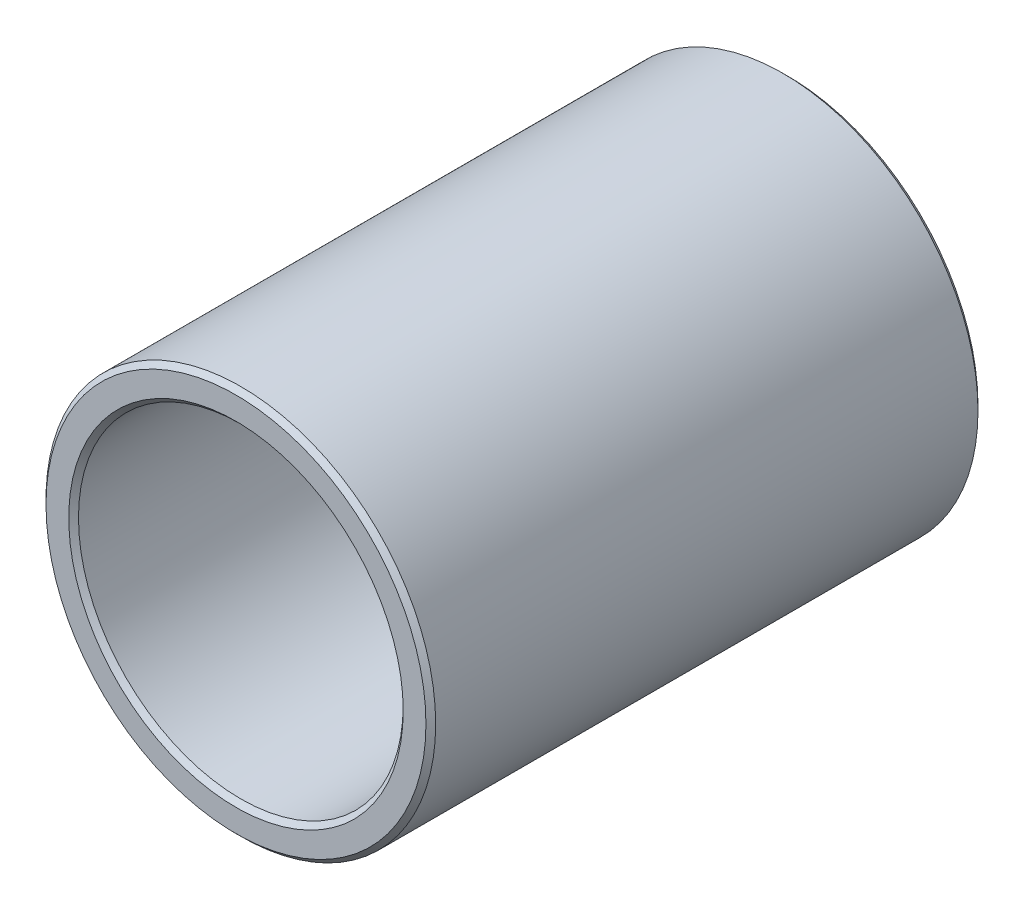
ISO-10303-21;
HEADER;
FILE_DESCRIPTION(('STEP AP214'),'2;1');
FILE_NAME('part.step','',(''),(''),'','','');
FILE_SCHEMA(('AUTOMOTIVE_DESIGN { 1 0 10303 214 1 1 1 1 }'));
ENDSEC;
DATA;
#1=APPLICATION_CONTEXT('core data for automotive mechanical design processes');
#2=APPLICATION_PROTOCOL_DEFINITION('international standard','automotive_design',2000,#1);
#3=PRODUCT_CONTEXT('',#1,'mechanical');
#4=PRODUCT('Part','Part','',(#3));
#5=PRODUCT_RELATED_PRODUCT_CATEGORY('part','',(#4));
#6=PRODUCT_DEFINITION_FORMATION('','',#4);
#7=PRODUCT_DEFINITION_CONTEXT('part definition',#1,'design');
#8=PRODUCT_DEFINITION('design','',#6,#7);
#9=PRODUCT_DEFINITION_SHAPE('','',#8);
#10=(LENGTH_UNIT() NAMED_UNIT(*) SI_UNIT(.MILLI.,.METRE.));
#11=(NAMED_UNIT(*) PLANE_ANGLE_UNIT() SI_UNIT($,.RADIAN.));
#12=(NAMED_UNIT(*) SI_UNIT($,.STERADIAN.) SOLID_ANGLE_UNIT());
#13=UNCERTAINTY_MEASURE_WITH_UNIT(LENGTH_MEASURE(1.E-05),#10,'distance_accuracy_value','');
#14=(GEOMETRIC_REPRESENTATION_CONTEXT(3) GLOBAL_UNCERTAINTY_ASSIGNED_CONTEXT((#13)) GLOBAL_UNIT_ASSIGNED_CONTEXT((#10,
#11,#12)) REPRESENTATION_CONTEXT('',''));
#15=CARTESIAN_POINT('',(0.,0.,0.));
#16=DIRECTION('',(0.,0.,1.));
#17=DIRECTION('',(1.,0.,0.));
#18=AXIS2_PLACEMENT_3D('',#15,#16,#17);
#19=CARTESIAN_POINT('',(0.,0.,34.));
#20=DIRECTION('',(0.,0.,1.));
#21=DIRECTION('',(1.,0.,0.));
#22=AXIS2_PLACEMENT_3D('',#19,#20,#21);
#23=PLANE('',#22);
#24=CARTESIAN_POINT('',(0.,0.,34.));
#25=DIRECTION('',(0.,0.,1.));
#26=DIRECTION('',(1.,0.,0.));
#27=AXIS2_PLACEMENT_3D('',#24,#25,#26);
#28=CIRCLE('',#27,10.2999999999998);
#29=CARTESIAN_POINT('',(10.2999999999998,0.,34.));
#30=VERTEX_POINT('',#29);
#31=EDGE_CURVE('E10',#30,#30,#28,.F.);
#32=ORIENTED_EDGE('',*,*,#31,.T.);
#33=EDGE_LOOP('',(#32));
#34=FACE_BOUND('',#33,.T.);
#35=CARTESIAN_POINT('',(0.,0.,34.));
#36=DIRECTION('',(0.,0.,1.));
#37=DIRECTION('',(1.,0.,0.));
#38=AXIS2_PLACEMENT_3D('',#35,#36,#37);
#39=CIRCLE('',#38,11.7);
#40=CARTESIAN_POINT('',(11.7,0.,34.));
#41=VERTEX_POINT('',#40);
#42=EDGE_CURVE('E42',#41,#41,#39,.T.);
#43=ORIENTED_EDGE('',*,*,#42,.T.);
#44=EDGE_LOOP('',(#43));
#45=FACE_BOUND('',#44,.T.);
#46=ADVANCED_FACE('F35',(#34,#45),#23,.T.);
#47=CARTESIAN_POINT('',(0.,0.,0.));
#48=DIRECTION('',(0.,0.,1.));
#49=DIRECTION('',(1.,0.,0.));
#50=AXIS2_PLACEMENT_3D('',#47,#48,#49);
#51=PLANE('',#50);
#52=CARTESIAN_POINT('',(0.,0.,0.));
#53=DIRECTION('',(0.,0.,1.));
#54=DIRECTION('',(1.,0.,0.));
#55=AXIS2_PLACEMENT_3D('',#52,#53,#54);
#56=CIRCLE('',#55,10.2999999999998);
#57=CARTESIAN_POINT('',(10.2999999999998,0.,0.));
#58=VERTEX_POINT('',#57);
#59=EDGE_CURVE('E61',#58,#58,#56,.T.);
#60=ORIENTED_EDGE('',*,*,#59,.T.);
#61=EDGE_LOOP('',(#60));
#62=FACE_BOUND('',#61,.T.);
#63=CARTESIAN_POINT('',(0.,0.,0.));
#64=DIRECTION('',(0.,0.,1.));
#65=DIRECTION('',(1.,0.,0.));
#66=AXIS2_PLACEMENT_3D('',#63,#64,#65);
#67=CIRCLE('',#66,11.7);
#68=CARTESIAN_POINT('',(11.7,0.,0.));
#69=VERTEX_POINT('',#68);
#70=EDGE_CURVE('E64',#69,#69,#67,.F.);
#71=ORIENTED_EDGE('',*,*,#70,.T.);
#72=EDGE_LOOP('',(#71));
#73=FACE_BOUND('',#72,.T.);
#74=ADVANCED_FACE('F68',(#62,#73),#51,.F.);
#75=CARTESIAN_POINT('',(0.,0.,34.));
#76=DIRECTION('',(0.,0.,-1.));
#77=DIRECTION('',(-1.,0.,0.));
#78=AXIS2_PLACEMENT_3D('',#75,#76,#77);
#79=CYLINDRICAL_SURFACE('',#78,12.);
#80=CARTESIAN_POINT('',(0.,0.,0.299999999999995));
#81=DIRECTION('',(0.,0.,1.));
#82=DIRECTION('',(1.,0.,0.));
#83=AXIS2_PLACEMENT_3D('',#80,#81,#82);
#84=CIRCLE('',#83,12.);
#85=CARTESIAN_POINT('',(12.,0.,0.299999999999995));
#86=VERTEX_POINT('',#85);
#87=EDGE_CURVE('E46',#86,#86,#84,.T.);
#88=ORIENTED_EDGE('',*,*,#87,.T.);
#89=EDGE_LOOP('',(#88));
#90=FACE_BOUND('',#89,.T.);
#91=CARTESIAN_POINT('',(0.,0.,33.7));
#92=DIRECTION('',(0.,0.,1.));
#93=DIRECTION('',(1.,0.,0.));
#94=AXIS2_PLACEMENT_3D('',#91,#92,#93);
#95=CIRCLE('',#94,12.);
#96=CARTESIAN_POINT('',(12.,0.,33.7));
#97=VERTEX_POINT('',#96);
#98=EDGE_CURVE('E50',#97,#97,#95,.F.);
#99=ORIENTED_EDGE('',*,*,#98,.T.);
#100=EDGE_LOOP('',(#99));
#101=FACE_BOUND('',#100,.T.);
#102=ADVANCED_FACE('F78',(#90,#101),#79,.T.);
#103=CARTESIAN_POINT('',(0.,0.,34.));
#104=DIRECTION('',(0.,0.,-1.));
#105=DIRECTION('',(-1.,0.,0.));
#106=AXIS2_PLACEMENT_3D('',#103,#104,#105);
#107=CYLINDRICAL_SURFACE('',#106,9.99999999999979);
#108=CARTESIAN_POINT('',(0.,0.,0.300000000000002));
#109=DIRECTION('',(0.,0.,1.));
#110=DIRECTION('',(1.,0.,0.));
#111=AXIS2_PLACEMENT_3D('',#108,#109,#110);
#112=CIRCLE('',#111,9.99999999999979);
#113=CARTESIAN_POINT('',(9.99999999999979,0.,0.300000000000002));
#114=VERTEX_POINT('',#113);
#115=EDGE_CURVE('E55',#114,#114,#112,.F.);
#116=ORIENTED_EDGE('',*,*,#115,.T.);
#117=EDGE_LOOP('',(#116));
#118=FACE_BOUND('',#117,.T.);
#119=CARTESIAN_POINT('',(0.,0.,33.7));
#120=DIRECTION('',(0.,0.,1.));
#121=DIRECTION('',(1.,0.,0.));
#122=AXIS2_PLACEMENT_3D('',#119,#120,#121);
#123=CIRCLE('',#122,9.99999999999979);
#124=CARTESIAN_POINT('',(9.99999999999979,0.,33.7));
#125=VERTEX_POINT('',#124);
#126=EDGE_CURVE('E58',#125,#125,#123,.T.);
#127=ORIENTED_EDGE('',*,*,#126,.T.);
#128=EDGE_LOOP('',(#127));
#129=FACE_BOUND('',#128,.T.);
#130=ADVANCED_FACE('F81',(#118,#129),#107,.F.);
#131=CARTESIAN_POINT('',(0.,0.,0.));
#132=DIRECTION('',(0.,0.,-1.));
#133=DIRECTION('',(-1.,0.,0.));
#134=AXIS2_PLACEMENT_3D('',#131,#132,#133);
#135=CONICAL_SURFACE('',#134,10.2999999999998,0.785398163397454);
#136=ORIENTED_EDGE('',*,*,#115,.F.);
#137=EDGE_LOOP('',(#136));
#138=FACE_BOUND('',#137,.T.);
#139=ORIENTED_EDGE('',*,*,#59,.F.);
#140=EDGE_LOOP('',(#139));
#141=FACE_BOUND('',#140,.T.);
#142=ADVANCED_FACE('F74',(#138,#141),#135,.F.);
#143=CARTESIAN_POINT('',(0.,0.,0.299999999999995));
#144=DIRECTION('',(0.,0.,1.));
#145=DIRECTION('',(1.,0.,0.));
#146=AXIS2_PLACEMENT_3D('',#143,#144,#145);
#147=CONICAL_SURFACE('',#146,12.,0.785398163397454);
#148=ORIENTED_EDGE('',*,*,#70,.F.);
#149=EDGE_LOOP('',(#148));
#150=FACE_BOUND('',#149,.T.);
#151=ORIENTED_EDGE('',*,*,#87,.F.);
#152=EDGE_LOOP('',(#151));
#153=FACE_BOUND('',#152,.T.);
#154=ADVANCED_FACE('F70',(#150,#153),#147,.T.);
#155=CARTESIAN_POINT('',(0.,0.,33.7));
#156=DIRECTION('',(0.,0.,1.));
#157=DIRECTION('',(1.,0.,0.));
#158=AXIS2_PLACEMENT_3D('',#155,#156,#157);
#159=CONICAL_SURFACE('',#158,9.99999999999979,0.785398163397448);
#160=ORIENTED_EDGE('',*,*,#31,.F.);
#161=EDGE_LOOP('',(#160));
#162=FACE_BOUND('',#161,.T.);
#163=ORIENTED_EDGE('',*,*,#126,.F.);
#164=EDGE_LOOP('',(#163));
#165=FACE_BOUND('',#164,.T.);
#166=ADVANCED_FACE('F73',(#162,#165),#159,.F.);
#167=CARTESIAN_POINT('',(0.,0.,34.));
#168=DIRECTION('',(0.,0.,-1.));
#169=DIRECTION('',(-1.,0.,0.));
#170=AXIS2_PLACEMENT_3D('',#167,#168,#169);
#171=CONICAL_SURFACE('',#170,11.7,0.785398163397448);
#172=ORIENTED_EDGE('',*,*,#98,.F.);
#173=EDGE_LOOP('',(#172));
#174=FACE_BOUND('',#173,.T.);
#175=ORIENTED_EDGE('',*,*,#42,.F.);
#176=EDGE_LOOP('',(#175));
#177=FACE_BOUND('',#176,.T.);
#178=ADVANCED_FACE('F37',(#174,#177),#171,.T.);
#179=CLOSED_SHELL('',(#46,#74,#102,#130,#142,#154,#166,#178));
#180=MANIFOLD_SOLID_BREP('B2',#179);
#181=ADVANCED_BREP_SHAPE_REPRESENTATION('',(#18,#180),#14);
#182=SHAPE_DEFINITION_REPRESENTATION(#9,#181);
ENDSEC;
END-ISO-10303-21;
